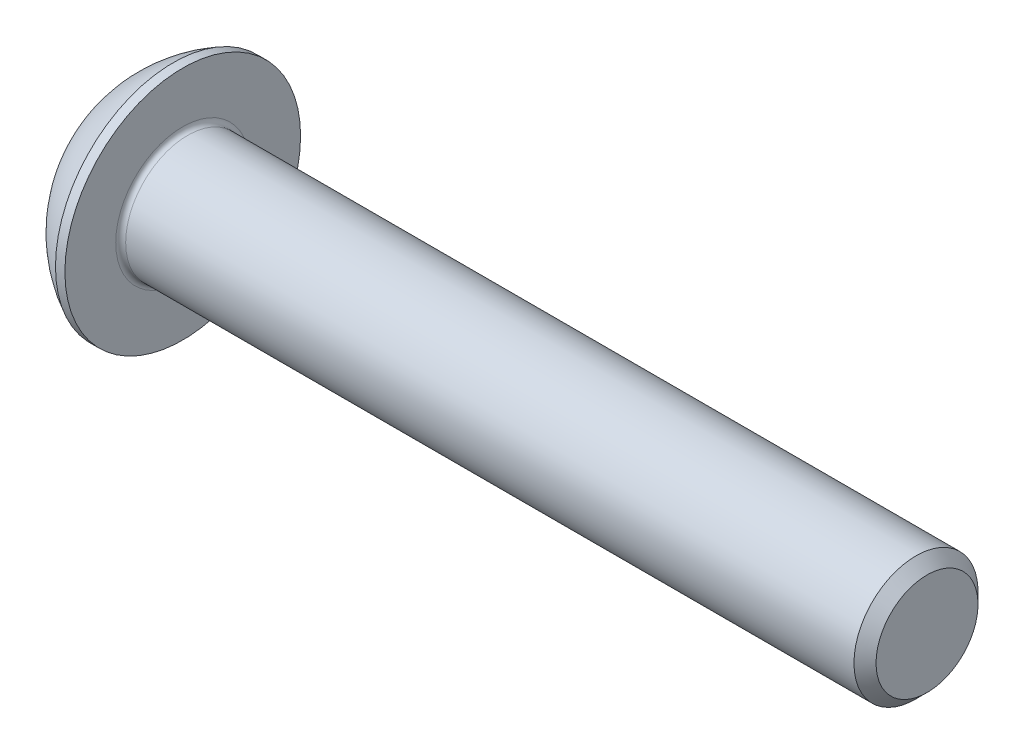
ISO-10303-21;
HEADER;
FILE_DESCRIPTION(('STEP AP214'),'2;1');
FILE_NAME('part.step','',(''),(''),'','','');
FILE_SCHEMA(('AUTOMOTIVE_DESIGN { 1 0 10303 214 1 1 1 1 }'));
ENDSEC;
DATA;
#1=APPLICATION_CONTEXT('core data for automotive mechanical design processes');
#2=APPLICATION_PROTOCOL_DEFINITION('international standard','automotive_design',2000,#1);
#3=PRODUCT_CONTEXT('',#1,'mechanical');
#4=PRODUCT('Part','Part','',(#3));
#5=PRODUCT_RELATED_PRODUCT_CATEGORY('part','',(#4));
#6=PRODUCT_DEFINITION_FORMATION('','',#4);
#7=PRODUCT_DEFINITION_CONTEXT('part definition',#1,'design');
#8=PRODUCT_DEFINITION('design','',#6,#7);
#9=PRODUCT_DEFINITION_SHAPE('','',#8);
#10=(LENGTH_UNIT() NAMED_UNIT(*) SI_UNIT(.MILLI.,.METRE.));
#11=(NAMED_UNIT(*) PLANE_ANGLE_UNIT() SI_UNIT($,.RADIAN.));
#12=(NAMED_UNIT(*) SI_UNIT($,.STERADIAN.) SOLID_ANGLE_UNIT());
#13=UNCERTAINTY_MEASURE_WITH_UNIT(LENGTH_MEASURE(1.E-05),#10,'distance_accuracy_value','');
#14=(GEOMETRIC_REPRESENTATION_CONTEXT(3) GLOBAL_UNCERTAINTY_ASSIGNED_CONTEXT((#13)) GLOBAL_UNIT_ASSIGNED_CONTEXT((#10,
#11,#12)) REPRESENTATION_CONTEXT('',''));
#15=CARTESIAN_POINT('',(0.,0.,0.));
#16=DIRECTION('',(0.,0.,1.));
#17=DIRECTION('',(1.,0.,0.));
#18=AXIS2_PLACEMENT_3D('',#15,#16,#17);
#19=CARTESIAN_POINT('',(0.,0.,0.));
#20=DIRECTION('',(-1.,0.,0.));
#21=DIRECTION('',(0.,0.,1.));
#22=AXIS2_PLACEMENT_3D('',#19,#20,#21);
#23=PLANE('',#22);
#24=CARTESIAN_POINT('',(0.,0.,0.));
#25=DIRECTION('',(-1.,0.,0.));
#26=DIRECTION('',(0.,0.,1.));
#27=AXIS2_PLACEMENT_3D('',#24,#25,#26);
#28=CIRCLE('',#27,2.375);
#29=CARTESIAN_POINT('',(0.,0.,2.375));
#30=VERTEX_POINT('',#29);
#31=EDGE_CURVE('E155',#30,#30,#28,.T.);
#32=ORIENTED_EDGE('',*,*,#31,.T.);
#33=EDGE_LOOP('',(#32));
#34=FACE_BOUND('',#33,.T.);
#35=DIRECTION('',(0.,-1.,0.));
#36=VECTOR('',#35,1.);
#37=CARTESIAN_POINT('',(0.,-0.866025403784438,1.5));
#38=LINE('',#37,#36);
#39=CARTESIAN_POINT('',(0.,0.866025403784439,1.5));
#40=VERTEX_POINT('',#39);
#41=CARTESIAN_POINT('',(0.,-0.866025403784438,1.5));
#42=VERTEX_POINT('',#41);
#43=EDGE_CURVE('E50',#40,#42,#38,.T.);
#44=ORIENTED_EDGE('',*,*,#43,.T.);
#45=DIRECTION('',(0.,-0.5,-0.866025403784438));
#46=VECTOR('',#45,1.);
#47=CARTESIAN_POINT('',(0.,-1.73205080756888,0.));
#48=LINE('',#47,#46);
#49=CARTESIAN_POINT('',(0.,-1.73205080756888,0.));
#50=VERTEX_POINT('',#49);
#51=EDGE_CURVE('E275',#42,#50,#48,.T.);
#52=ORIENTED_EDGE('',*,*,#51,.T.);
#53=DIRECTION('',(0.,0.5,-0.866025403784439));
#54=VECTOR('',#53,1.);
#55=CARTESIAN_POINT('',(0.,-0.866025403784438,-1.5));
#56=LINE('',#55,#54);
#57=CARTESIAN_POINT('',(0.,-0.866025403784438,-1.5));
#58=VERTEX_POINT('',#57);
#59=EDGE_CURVE('E130',#50,#58,#56,.T.);
#60=ORIENTED_EDGE('',*,*,#59,.T.);
#61=DIRECTION('',(0.,1.,0.));
#62=VECTOR('',#61,1.);
#63=CARTESIAN_POINT('',(0.,0.866025403784439,-1.5));
#64=LINE('',#63,#62);
#65=CARTESIAN_POINT('',(0.,0.866025403784439,-1.5));
#66=VERTEX_POINT('',#65);
#67=EDGE_CURVE('E278',#58,#66,#64,.T.);
#68=ORIENTED_EDGE('',*,*,#67,.T.);
#69=DIRECTION('',(0.,0.5,0.866025403784439));
#70=VECTOR('',#69,1.);
#71=CARTESIAN_POINT('',(0.,1.73205080756888,0.));
#72=LINE('',#71,#70);
#73=CARTESIAN_POINT('',(0.,1.73205080756888,0.));
#74=VERTEX_POINT('',#73);
#75=EDGE_CURVE('E280',#66,#74,#72,.T.);
#76=ORIENTED_EDGE('',*,*,#75,.T.);
#77=DIRECTION('',(0.,-0.5,0.866025403784439));
#78=VECTOR('',#77,1.);
#79=CARTESIAN_POINT('',(0.,0.866025403784439,1.5));
#80=LINE('',#79,#78);
#81=EDGE_CURVE('E282',#74,#40,#80,.T.);
#82=ORIENTED_EDGE('',*,*,#81,.T.);
#83=EDGE_LOOP('',(#44,#52,#60,#68,#76,#82));
#84=FACE_BOUND('',#83,.T.);
#85=ADVANCED_FACE('F35',(#34,#84),#23,.T.);
#86=CARTESIAN_POINT('',(4.75501582278481,0.,0.));
#87=DIRECTION('',(-1.,0.,0.));
#88=DIRECTION('',(0.,1.,0.));
#89=AXIS2_PLACEMENT_3D('',#86,#87,#88);
#90=SPHERICAL_SURFACE('',#89,5.3151482081814);
#91=CARTESIAN_POINT('',(2.37,0.,0.));
#92=DIRECTION('',(-1.,0.,0.));
#93=DIRECTION('',(0.,0.,1.));
#94=AXIS2_PLACEMENT_3D('',#91,#92,#93);
#95=CIRCLE('',#94,4.75);
#96=CARTESIAN_POINT('',(2.37,0.,4.75));
#97=VERTEX_POINT('',#96);
#98=EDGE_CURVE('E152',#97,#97,#95,.T.);
#99=ORIENTED_EDGE('',*,*,#98,.T.);
#100=EDGE_LOOP('',(#99));
#101=FACE_BOUND('',#100,.T.);
#102=ORIENTED_EDGE('',*,*,#31,.F.);
#103=EDGE_LOOP('',(#102));
#104=FACE_BOUND('',#103,.T.);
#105=ADVANCED_FACE('F176',(#101,#104),#90,.T.);
#106=CARTESIAN_POINT('',(0.,0.,0.));
#107=DIRECTION('',(-1.,0.,0.));
#108=DIRECTION('',(0.,0.,1.));
#109=AXIS2_PLACEMENT_3D('',#106,#107,#108);
#110=CYLINDRICAL_SURFACE('',#109,4.75);
#111=ORIENTED_EDGE('',*,*,#98,.F.);
#112=EDGE_LOOP('',(#111));
#113=FACE_BOUND('',#112,.T.);
#114=CARTESIAN_POINT('',(2.75,0.,0.));
#115=DIRECTION('',(-1.,0.,0.));
#116=DIRECTION('',(0.,0.,1.));
#117=AXIS2_PLACEMENT_3D('',#114,#115,#116);
#118=CIRCLE('',#117,4.75);
#119=CARTESIAN_POINT('',(2.75,0.,4.75));
#120=VERTEX_POINT('',#119);
#121=EDGE_CURVE('E149',#120,#120,#118,.T.);
#122=ORIENTED_EDGE('',*,*,#121,.T.);
#123=EDGE_LOOP('',(#122));
#124=FACE_BOUND('',#123,.T.);
#125=ADVANCED_FACE('F181',(#113,#124),#110,.T.);
#126=CARTESIAN_POINT('',(2.75,2.5,0.));
#127=DIRECTION('',(-1.,0.,0.));
#128=DIRECTION('',(0.,0.,1.));
#129=AXIS2_PLACEMENT_3D('',#126,#127,#128);
#130=PLANE('',#129);
#131=CARTESIAN_POINT('',(2.75,0.,0.));
#132=DIRECTION('',(-1.,0.,0.));
#133=DIRECTION('',(0.,0.,1.));
#134=AXIS2_PLACEMENT_3D('',#131,#132,#133);
#135=CIRCLE('',#134,2.7);
#136=CARTESIAN_POINT('',(2.75,0.,2.7));
#137=VERTEX_POINT('',#136);
#138=EDGE_CURVE('E43',#137,#137,#135,.T.);
#139=ORIENTED_EDGE('',*,*,#138,.T.);
#140=EDGE_LOOP('',(#139));
#141=FACE_BOUND('',#140,.T.);
#142=ORIENTED_EDGE('',*,*,#121,.F.);
#143=EDGE_LOOP('',(#142));
#144=FACE_BOUND('',#143,.T.);
#145=ADVANCED_FACE('F160',(#141,#144),#130,.F.);
#146=CARTESIAN_POINT('',(0.,0.,0.));
#147=DIRECTION('',(-1.,0.,0.));
#148=DIRECTION('',(0.,0.,1.));
#149=AXIS2_PLACEMENT_3D('',#146,#147,#148);
#150=CYLINDRICAL_SURFACE('',#149,2.5);
#151=CARTESIAN_POINT('',(2.95,0.,0.));
#152=DIRECTION('',(-1.,0.,0.));
#153=DIRECTION('',(0.,0.,1.));
#154=AXIS2_PLACEMENT_3D('',#151,#152,#153);
#155=CIRCLE('',#154,2.5);
#156=CARTESIAN_POINT('',(2.95,0.,2.5));
#157=VERTEX_POINT('',#156);
#158=EDGE_CURVE('E11',#157,#157,#155,.F.);
#159=ORIENTED_EDGE('',*,*,#158,.T.);
#160=EDGE_LOOP('',(#159));
#161=FACE_BOUND('',#160,.T.);
#162=CARTESIAN_POINT('',(32.305,0.,0.));
#163=DIRECTION('',(-1.,0.,0.));
#164=DIRECTION('',(0.,0.,1.));
#165=AXIS2_PLACEMENT_3D('',#162,#163,#164);
#166=CIRCLE('',#165,2.5);
#167=CARTESIAN_POINT('',(32.305,0.,2.5));
#168=VERTEX_POINT('',#167);
#169=EDGE_CURVE('E146',#168,#168,#166,.T.);
#170=ORIENTED_EDGE('',*,*,#169,.T.);
#171=EDGE_LOOP('',(#170));
#172=FACE_BOUND('',#171,.T.);
#173=ADVANCED_FACE('F190',(#161,#172),#150,.T.);
#174=CARTESIAN_POINT('',(32.75,0.,0.));
#175=DIRECTION('',(-1.,0.,0.));
#176=DIRECTION('',(0.,0.,1.));
#177=AXIS2_PLACEMENT_3D('',#174,#175,#176);
#178=CONICAL_SURFACE('',#177,2.055,0.785398163397435);
#179=ORIENTED_EDGE('',*,*,#169,.F.);
#180=EDGE_LOOP('',(#179));
#181=FACE_BOUND('',#180,.T.);
#182=CARTESIAN_POINT('',(32.75,0.,0.));
#183=DIRECTION('',(-1.,0.,0.));
#184=DIRECTION('',(0.,0.,1.));
#185=AXIS2_PLACEMENT_3D('',#182,#183,#184);
#186=CIRCLE('',#185,2.055);
#187=CARTESIAN_POINT('',(32.75,0.,2.055));
#188=VERTEX_POINT('',#187);
#189=EDGE_CURVE('E142',#188,#188,#186,.T.);
#190=ORIENTED_EDGE('',*,*,#189,.T.);
#191=EDGE_LOOP('',(#190));
#192=FACE_BOUND('',#191,.T.);
#193=ADVANCED_FACE('F171',(#181,#192),#178,.T.);
#194=CARTESIAN_POINT('',(32.75,0.,0.));
#195=DIRECTION('',(-1.,0.,0.));
#196=DIRECTION('',(0.,0.,1.));
#197=AXIS2_PLACEMENT_3D('',#194,#195,#196);
#198=PLANE('',#197);
#199=ORIENTED_EDGE('',*,*,#189,.F.);
#200=EDGE_LOOP('',(#199));
#201=FACE_BOUND('',#200,.T.);
#202=ADVANCED_FACE('F164',(#201),#198,.F.);
#203=CARTESIAN_POINT('',(2.95,0.,0.));
#204=DIRECTION('',(-1.,0.,0.));
#205=DIRECTION('',(0.,0.,1.));
#206=AXIS2_PLACEMENT_3D('',#203,#204,#205);
#207=TOROIDAL_SURFACE('',#206,2.7,0.2);
#208=ORIENTED_EDGE('',*,*,#158,.F.);
#209=EDGE_LOOP('',(#208));
#210=FACE_BOUND('',#209,.T.);
#211=ORIENTED_EDGE('',*,*,#138,.F.);
#212=EDGE_LOOP('',(#211));
#213=FACE_BOUND('',#212,.T.);
#214=ADVANCED_FACE('F37',(#210,#213),#207,.F.);
#215=CARTESIAN_POINT('',(1.56,-1.73205080756888,0.));
#216=DIRECTION('',(0.,0.866025403784438,-0.5));
#217=DIRECTION('',(0.,0.5,0.866025403784438));
#218=AXIS2_PLACEMENT_3D('',#215,#216,#217);
#219=PLANE('',#218);
#220=DIRECTION('',(0.,-0.5,-0.866025403784438));
#221=VECTOR('',#220,1.);
#222=CARTESIAN_POINT('',(1.56,-1.73205080756888,0.));
#223=LINE('',#222,#221);
#224=CARTESIAN_POINT('',(1.56,-0.866025403784438,1.5));
#225=VERTEX_POINT('',#224);
#226=CARTESIAN_POINT('',(1.56,-1.29903810567666,0.75));
#227=VERTEX_POINT('',#226);
#228=EDGE_CURVE('E116',#225,#227,#223,.T.);
#229=ORIENTED_EDGE('',*,*,#228,.T.);
#230=CARTESIAN_POINT('',(1.56,-1.73205080756888,0.));
#231=VERTEX_POINT('',#230);
#232=EDGE_CURVE('E111',#227,#231,#223,.T.);
#233=ORIENTED_EDGE('',*,*,#232,.T.);
#234=DIRECTION('',(-1.,0.,0.));
#235=VECTOR('',#234,1.);
#236=CARTESIAN_POINT('',(1.56,-1.73205080756888,0.));
#237=LINE('',#236,#235);
#238=EDGE_CURVE('E113',#231,#50,#237,.T.);
#239=ORIENTED_EDGE('',*,*,#238,.T.);
#240=ORIENTED_EDGE('',*,*,#51,.F.);
#241=DIRECTION('',(-1.,0.,0.));
#242=VECTOR('',#241,1.);
#243=CARTESIAN_POINT('',(1.56,-0.866025403784438,1.5));
#244=LINE('',#243,#242);
#245=EDGE_CURVE('E271',#225,#42,#244,.T.);
#246=ORIENTED_EDGE('',*,*,#245,.F.);
#247=EDGE_LOOP('',(#229,#233,#239,#240,#246));
#248=FACE_BOUND('',#247,.T.);
#249=ADVANCED_FACE('F112',(#248),#219,.T.);
#250=CARTESIAN_POINT('',(1.56,-0.866025403784438,-1.5));
#251=DIRECTION('',(0.,0.866025403784438,0.5));
#252=DIRECTION('',(0.,-0.5,0.866025403784438));
#253=AXIS2_PLACEMENT_3D('',#250,#251,#252);
#254=PLANE('',#253);
#255=DIRECTION('',(0.,0.5,-0.866025403784439));
#256=VECTOR('',#255,1.);
#257=CARTESIAN_POINT('',(1.56,-0.866025403784438,-1.5));
#258=LINE('',#257,#256);
#259=CARTESIAN_POINT('',(1.56,-1.29903810567666,-0.750000000000001));
#260=VERTEX_POINT('',#259);
#261=EDGE_CURVE('E58',#231,#260,#258,.T.);
#262=ORIENTED_EDGE('',*,*,#261,.T.);
#263=CARTESIAN_POINT('',(1.56,-0.866025403784438,-1.5));
#264=VERTEX_POINT('',#263);
#265=EDGE_CURVE('E125',#260,#264,#258,.T.);
#266=ORIENTED_EDGE('',*,*,#265,.T.);
#267=DIRECTION('',(-1.,0.,0.));
#268=VECTOR('',#267,1.);
#269=CARTESIAN_POINT('',(1.56,-0.866025403784438,-1.5));
#270=LINE('',#269,#268);
#271=EDGE_CURVE('E132',#264,#58,#270,.T.);
#272=ORIENTED_EDGE('',*,*,#271,.T.);
#273=ORIENTED_EDGE('',*,*,#59,.F.);
#274=ORIENTED_EDGE('',*,*,#238,.F.);
#275=EDGE_LOOP('',(#262,#266,#272,#273,#274));
#276=FACE_BOUND('',#275,.T.);
#277=ADVANCED_FACE('F128',(#276),#254,.T.);
#278=CARTESIAN_POINT('',(1.56,0.866025403784439,-1.5));
#279=DIRECTION('',(0.,0.,1.));
#280=DIRECTION('',(1.,0.,0.));
#281=AXIS2_PLACEMENT_3D('',#278,#279,#280);
#282=PLANE('',#281);
#283=DIRECTION('',(0.,1.,0.));
#284=VECTOR('',#283,1.);
#285=CARTESIAN_POINT('',(1.56,0.866025403784439,-1.5));
#286=LINE('',#285,#284);
#287=CARTESIAN_POINT('',(1.56,0.,-1.5));
#288=VERTEX_POINT('',#287);
#289=EDGE_CURVE('E252',#264,#288,#286,.T.);
#290=ORIENTED_EDGE('',*,*,#289,.T.);
#291=CARTESIAN_POINT('',(1.56,0.866025403784439,-1.5));
#292=VERTEX_POINT('',#291);
#293=EDGE_CURVE('E124',#288,#292,#286,.T.);
#294=ORIENTED_EDGE('',*,*,#293,.T.);
#295=DIRECTION('',(-1.,0.,0.));
#296=VECTOR('',#295,1.);
#297=CARTESIAN_POINT('',(1.56,0.866025403784439,-1.5));
#298=LINE('',#297,#296);
#299=EDGE_CURVE('E137',#292,#66,#298,.T.);
#300=ORIENTED_EDGE('',*,*,#299,.T.);
#301=ORIENTED_EDGE('',*,*,#67,.F.);
#302=ORIENTED_EDGE('',*,*,#271,.F.);
#303=EDGE_LOOP('',(#290,#294,#300,#301,#302));
#304=FACE_BOUND('',#303,.T.);
#305=ADVANCED_FACE('F204',(#304),#282,.T.);
#306=CARTESIAN_POINT('',(1.56,1.73205080756888,0.));
#307=DIRECTION('',(0.,-0.866025403784439,0.5));
#308=DIRECTION('',(0.,-0.5,-0.866025403784439));
#309=AXIS2_PLACEMENT_3D('',#306,#307,#308);
#310=PLANE('',#309);
#311=DIRECTION('',(0.,0.5,0.866025403784439));
#312=VECTOR('',#311,1.);
#313=CARTESIAN_POINT('',(1.56,1.73205080756888,0.));
#314=LINE('',#313,#312);
#315=CARTESIAN_POINT('',(1.56,1.29903810567666,-0.75));
#316=VERTEX_POINT('',#315);
#317=EDGE_CURVE('E241',#292,#316,#314,.T.);
#318=ORIENTED_EDGE('',*,*,#317,.T.);
#319=CARTESIAN_POINT('',(1.56,1.73205080756888,0.));
#320=VERTEX_POINT('',#319);
#321=EDGE_CURVE('E246',#316,#320,#314,.T.);
#322=ORIENTED_EDGE('',*,*,#321,.T.);
#323=DIRECTION('',(-1.,0.,0.));
#324=VECTOR('',#323,1.);
#325=CARTESIAN_POINT('',(1.56,1.73205080756888,0.));
#326=LINE('',#325,#324);
#327=EDGE_CURVE('E286',#320,#74,#326,.T.);
#328=ORIENTED_EDGE('',*,*,#327,.T.);
#329=ORIENTED_EDGE('',*,*,#75,.F.);
#330=ORIENTED_EDGE('',*,*,#299,.F.);
#331=EDGE_LOOP('',(#318,#322,#328,#329,#330));
#332=FACE_BOUND('',#331,.T.);
#333=ADVANCED_FACE('F207',(#332),#310,.T.);
#334=CARTESIAN_POINT('',(1.56,0.866025403784439,1.5));
#335=DIRECTION('',(0.,-0.866025403784439,-0.5));
#336=DIRECTION('',(0.,0.5,-0.866025403784439));
#337=AXIS2_PLACEMENT_3D('',#334,#335,#336);
#338=PLANE('',#337);
#339=DIRECTION('',(0.,-0.5,0.866025403784439));
#340=VECTOR('',#339,1.);
#341=CARTESIAN_POINT('',(1.56,0.866025403784439,1.5));
#342=LINE('',#341,#340);
#343=CARTESIAN_POINT('',(1.56,1.29903810567666,0.75));
#344=VERTEX_POINT('',#343);
#345=EDGE_CURVE('E249',#320,#344,#342,.T.);
#346=ORIENTED_EDGE('',*,*,#345,.T.);
#347=CARTESIAN_POINT('',(1.56,0.866025403784439,1.5));
#348=VERTEX_POINT('',#347);
#349=EDGE_CURVE('E257',#344,#348,#342,.T.);
#350=ORIENTED_EDGE('',*,*,#349,.T.);
#351=DIRECTION('',(-1.,0.,0.));
#352=VECTOR('',#351,1.);
#353=CARTESIAN_POINT('',(1.56,0.866025403784439,1.5));
#354=LINE('',#353,#352);
#355=EDGE_CURVE('E270',#348,#40,#354,.T.);
#356=ORIENTED_EDGE('',*,*,#355,.T.);
#357=ORIENTED_EDGE('',*,*,#81,.F.);
#358=ORIENTED_EDGE('',*,*,#327,.F.);
#359=EDGE_LOOP('',(#346,#350,#356,#357,#358));
#360=FACE_BOUND('',#359,.T.);
#361=ADVANCED_FACE('F211',(#360),#338,.T.);
#362=CARTESIAN_POINT('',(1.56,-0.866025403784438,1.5));
#363=DIRECTION('',(0.,0.,-1.));
#364=DIRECTION('',(0.,1.,0.));
#365=AXIS2_PLACEMENT_3D('',#362,#363,#364);
#366=PLANE('',#365);
#367=DIRECTION('',(0.,-1.,0.));
#368=VECTOR('',#367,1.);
#369=CARTESIAN_POINT('',(1.56,-0.866025403784438,1.5));
#370=LINE('',#369,#368);
#371=CARTESIAN_POINT('',(1.56,0.,1.5));
#372=VERTEX_POINT('',#371);
#373=EDGE_CURVE('E263',#348,#372,#370,.T.);
#374=ORIENTED_EDGE('',*,*,#373,.T.);
#375=EDGE_CURVE('E265',#372,#225,#370,.T.);
#376=ORIENTED_EDGE('',*,*,#375,.T.);
#377=ORIENTED_EDGE('',*,*,#245,.T.);
#378=ORIENTED_EDGE('',*,*,#43,.F.);
#379=ORIENTED_EDGE('',*,*,#355,.F.);
#380=EDGE_LOOP('',(#374,#376,#377,#378,#379));
#381=FACE_BOUND('',#380,.T.);
#382=ADVANCED_FACE('F215',(#381),#366,.T.);
#383=CARTESIAN_POINT('',(1.56,-1.73205080756888,0.));
#384=DIRECTION('',(1.,0.,0.));
#385=DIRECTION('',(0.,0.,-1.));
#386=AXIS2_PLACEMENT_3D('',#383,#384,#385);
#387=PLANE('',#386);
#388=CARTESIAN_POINT('',(1.56,0.,0.));
#389=DIRECTION('',(-1.,0.,0.));
#390=DIRECTION('',(0.,0.,1.));
#391=AXIS2_PLACEMENT_3D('',#388,#389,#390);
#392=CIRCLE('',#391,1.5);
#393=EDGE_CURVE('E238',#316,#288,#392,.T.);
#394=ORIENTED_EDGE('',*,*,#393,.F.);
#395=ORIENTED_EDGE('',*,*,#317,.F.);
#396=ORIENTED_EDGE('',*,*,#293,.F.);
#397=EDGE_LOOP('',(#394,#395,#396));
#398=FACE_BOUND('',#397,.T.);
#399=ADVANCED_FACE('F219',(#398),#387,.F.);
#400=EDGE_CURVE('E143',#344,#316,#392,.T.);
#401=ORIENTED_EDGE('',*,*,#400,.F.);
#402=ORIENTED_EDGE('',*,*,#345,.F.);
#403=ORIENTED_EDGE('',*,*,#321,.F.);
#404=EDGE_LOOP('',(#401,#402,#403));
#405=FACE_BOUND('',#404,.T.);
#406=ADVANCED_FACE('F228',(#405),#387,.F.);
#407=EDGE_CURVE('E136',#372,#344,#392,.T.);
#408=ORIENTED_EDGE('',*,*,#407,.F.);
#409=ORIENTED_EDGE('',*,*,#373,.F.);
#410=ORIENTED_EDGE('',*,*,#349,.F.);
#411=EDGE_LOOP('',(#408,#409,#410));
#412=FACE_BOUND('',#411,.T.);
#413=ADVANCED_FACE('F233',(#412),#387,.F.);
#414=EDGE_CURVE('E131',#227,#372,#392,.T.);
#415=ORIENTED_EDGE('',*,*,#414,.F.);
#416=ORIENTED_EDGE('',*,*,#228,.F.);
#417=ORIENTED_EDGE('',*,*,#375,.F.);
#418=EDGE_LOOP('',(#415,#416,#417));
#419=FACE_BOUND('',#418,.T.);
#420=ADVANCED_FACE('F226',(#419),#387,.F.);
#421=EDGE_CURVE('E122',#260,#227,#392,.T.);
#422=ORIENTED_EDGE('',*,*,#421,.F.);
#423=ORIENTED_EDGE('',*,*,#261,.F.);
#424=ORIENTED_EDGE('',*,*,#232,.F.);
#425=EDGE_LOOP('',(#422,#423,#424));
#426=FACE_BOUND('',#425,.T.);
#427=ADVANCED_FACE('F121',(#426),#387,.F.);
#428=EDGE_CURVE('E244',#288,#260,#392,.T.);
#429=ORIENTED_EDGE('',*,*,#428,.F.);
#430=ORIENTED_EDGE('',*,*,#289,.F.);
#431=ORIENTED_EDGE('',*,*,#265,.F.);
#432=EDGE_LOOP('',(#429,#430,#431));
#433=FACE_BOUND('',#432,.T.);
#434=ADVANCED_FACE('F199',(#433),#387,.F.);
#435=CARTESIAN_POINT('',(2.42602540378445,0.,0.));
#436=DIRECTION('',(-1.,0.,0.));
#437=DIRECTION('',(0.,0.,1.));
#438=AXIS2_PLACEMENT_3D('',#435,#436,#437);
#439=CONICAL_SURFACE('',#438,0.,1.04719755119659);
#440=ORIENTED_EDGE('',*,*,#407,.T.);
#441=ORIENTED_EDGE('',*,*,#400,.T.);
#442=ORIENTED_EDGE('',*,*,#393,.T.);
#443=ORIENTED_EDGE('',*,*,#428,.T.);
#444=ORIENTED_EDGE('',*,*,#421,.T.);
#445=ORIENTED_EDGE('',*,*,#414,.T.);
#446=EDGE_LOOP('',(#440,#441,#442,#443,#444,#445));
#447=FACE_BOUND('',#446,.T.);
#448=CARTESIAN_POINT('',(2.42602540378445,0.,0.));
#449=VERTEX_POINT('',#448);
#450=VERTEX_LOOP('',#449);
#451=FACE_BOUND('',#450,.T.);
#452=ADVANCED_FACE('F197',(#447,#451),#439,.F.);
#453=CLOSED_SHELL('',(#85,#105,#125,#145,#173,#193,#202,#214,#249,#277,#305,#333,#361,#382,#399,
#406,#413,#420,#427,#434,#452));
#454=MANIFOLD_SOLID_BREP('B2',#453);
#455=ADVANCED_BREP_SHAPE_REPRESENTATION('',(#18,#454),#14);
#456=SHAPE_DEFINITION_REPRESENTATION(#9,#455);
ENDSEC;
END-ISO-10303-21;
